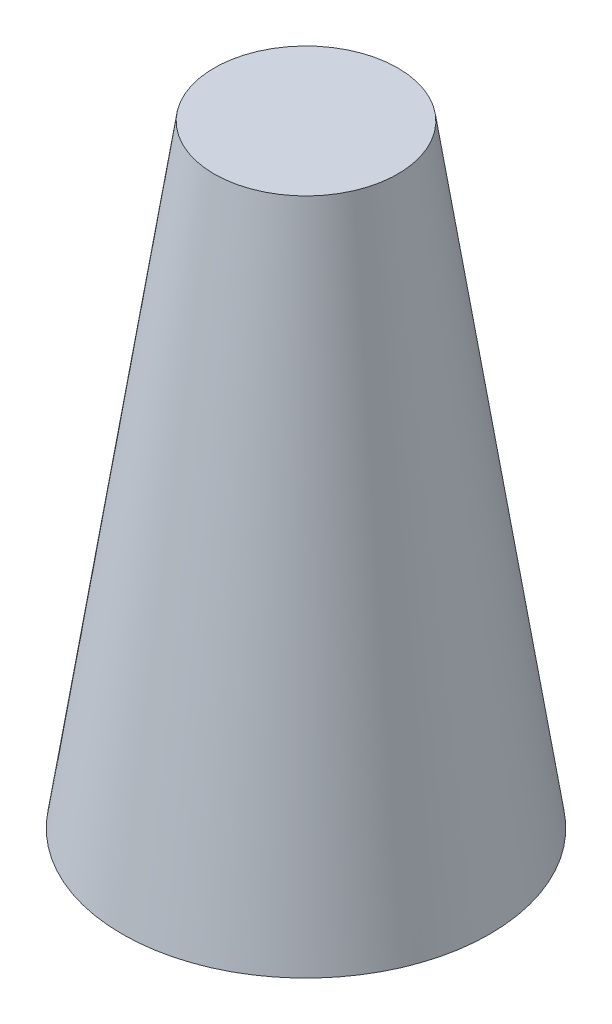
ISO-10303-21;
HEADER;
FILE_DESCRIPTION(('STEP AP214'),'2;1');
FILE_NAME('part.step','',(''),(''),'','','');
FILE_SCHEMA(('AUTOMOTIVE_DESIGN { 1 0 10303 214 1 1 1 1 }'));
ENDSEC;
DATA;
#1=APPLICATION_CONTEXT('core data for automotive mechanical design processes');
#2=APPLICATION_PROTOCOL_DEFINITION('international standard','automotive_design',2000,#1);
#3=PRODUCT_CONTEXT('',#1,'mechanical');
#4=PRODUCT('Part','Part','',(#3));
#5=PRODUCT_RELATED_PRODUCT_CATEGORY('part','',(#4));
#6=PRODUCT_DEFINITION_FORMATION('','',#4);
#7=PRODUCT_DEFINITION_CONTEXT('part definition',#1,'design');
#8=PRODUCT_DEFINITION('design','',#6,#7);
#9=PRODUCT_DEFINITION_SHAPE('','',#8);
#10=(LENGTH_UNIT() NAMED_UNIT(*) SI_UNIT(.MILLI.,.METRE.));
#11=(NAMED_UNIT(*) PLANE_ANGLE_UNIT() SI_UNIT($,.RADIAN.));
#12=(NAMED_UNIT(*) SI_UNIT($,.STERADIAN.) SOLID_ANGLE_UNIT());
#13=UNCERTAINTY_MEASURE_WITH_UNIT(LENGTH_MEASURE(1.E-05),#10,'distance_accuracy_value','');
#14=(GEOMETRIC_REPRESENTATION_CONTEXT(3) GLOBAL_UNCERTAINTY_ASSIGNED_CONTEXT((#13)) GLOBAL_UNIT_ASSIGNED_CONTEXT((#10,
#11,#12)) REPRESENTATION_CONTEXT('',''));
#15=CARTESIAN_POINT('',(0.,0.,0.));
#16=DIRECTION('',(0.,0.,1.));
#17=DIRECTION('',(1.,0.,0.));
#18=AXIS2_PLACEMENT_3D('',#15,#16,#17);
#19=CARTESIAN_POINT('',(0.,200.,0.));
#20=DIRECTION('',(0.,-1.,0.));
#21=DIRECTION('',(0.,0.,-1.));
#22=AXIS2_PLACEMENT_3D('',#19,#20,#21);
#23=PLANE('',#22);
#24=CARTESIAN_POINT('',(0.,200.,0.));
#25=DIRECTION('',(0.,-1.,0.));
#26=DIRECTION('',(0.,0.,-1.));
#27=AXIS2_PLACEMENT_3D('',#24,#25,#26);
#28=CIRCLE('',#27,30.);
#29=CARTESIAN_POINT('',(0.,200.,-30.));
#30=VERTEX_POINT('',#29);
#31=EDGE_CURVE('E60',#30,#30,#28,.T.);
#32=ORIENTED_EDGE('',*,*,#31,.F.);
#33=EDGE_LOOP('',(#32));
#34=FACE_BOUND('',#33,.T.);
#35=ADVANCED_FACE('F37',(#34),#23,.F.);
#36=CARTESIAN_POINT('',(0.,195.,0.));
#37=DIRECTION('',(0.,1.,0.));
#38=DIRECTION('',(0.,0.,1.));
#39=AXIS2_PLACEMENT_3D('',#36,#37,#38);
#40=PLANE('',#39);
#41=CARTESIAN_POINT('',(0.,195.,0.));
#42=DIRECTION('',(0.,-1.,0.));
#43=DIRECTION('',(0.,0.,-1.));
#44=AXIS2_PLACEMENT_3D('',#41,#42,#43);
#45=CIRCLE('',#44,17.0821886878825);
#46=CARTESIAN_POINT('',(0.,195.,-17.0821886878825));
#47=VERTEX_POINT('',#46);
#48=EDGE_CURVE('E10',#47,#47,#45,.T.);
#49=ORIENTED_EDGE('',*,*,#48,.T.);
#50=EDGE_LOOP('',(#49));
#51=FACE_BOUND('',#50,.T.);
#52=ADVANCED_FACE('F68',(#51),#40,.F.);
#53=CARTESIAN_POINT('',(0.,185.,0.));
#54=DIRECTION('',(0.,-1.,0.));
#55=DIRECTION('',(0.,0.,-1.));
#56=AXIS2_PLACEMENT_3D('',#53,#54,#55);
#57=TOROIDAL_SURFACE('',#56,17.0821886878825,10.);
#58=ORIENTED_EDGE('',*,*,#48,.F.);
#59=EDGE_LOOP('',(#58));
#60=FACE_BOUND('',#59,.T.);
#61=CARTESIAN_POINT('',(0.,186.483404529302,0.));
#62=DIRECTION('',(0.,-1.,0.));
#63=DIRECTION('',(0.,0.,-1.));
#64=AXIS2_PLACEMENT_3D('',#61,#62,#63);
#65=CIRCLE('',#64,26.9715522165655);
#66=CARTESIAN_POINT('',(0.,186.483404529302,-26.9715522165655));
#67=VERTEX_POINT('',#66);
#68=EDGE_CURVE('E44',#67,#67,#65,.T.);
#69=ORIENTED_EDGE('',*,*,#68,.T.);
#70=EDGE_LOOP('',(#69));
#71=FACE_BOUND('',#70,.T.);
#72=ADVANCED_FACE('F72',(#60,#71),#57,.F.);
#73=CARTESIAN_POINT('',(0.,0.,0.));
#74=DIRECTION('',(0.,-1.,0.));
#75=DIRECTION('',(0.,0.,-1.));
#76=AXIS2_PLACEMENT_3D('',#73,#74,#75);
#77=CONICAL_SURFACE('',#76,54.9440628959608,0.148889947609497);
#78=ORIENTED_EDGE('',*,*,#68,.F.);
#79=EDGE_LOOP('',(#78));
#80=FACE_BOUND('',#79,.T.);
#81=CARTESIAN_POINT('',(0.,0.,0.));
#82=DIRECTION('',(0.,-1.,0.));
#83=DIRECTION('',(0.,0.,-1.));
#84=AXIS2_PLACEMENT_3D('',#81,#82,#83);
#85=CIRCLE('',#84,54.9440628959608);
#86=CARTESIAN_POINT('',(0.,0.,-54.9440628959608));
#87=VERTEX_POINT('',#86);
#88=EDGE_CURVE('E49',#87,#87,#85,.T.);
#89=ORIENTED_EDGE('',*,*,#88,.T.);
#90=EDGE_LOOP('',(#89));
#91=FACE_BOUND('',#90,.T.);
#92=ADVANCED_FACE('F76',(#80,#91),#77,.F.);
#93=CARTESIAN_POINT('',(-60.,0.,0.));
#94=DIRECTION('',(0.,1.,0.));
#95=DIRECTION('',(0.,0.,1.));
#96=AXIS2_PLACEMENT_3D('',#93,#94,#95);
#97=PLANE('',#96);
#98=ORIENTED_EDGE('',*,*,#88,.F.);
#99=EDGE_LOOP('',(#98));
#100=FACE_BOUND('',#99,.T.);
#101=CARTESIAN_POINT('',(0.,0.,0.));
#102=DIRECTION('',(0.,-1.,0.));
#103=DIRECTION('',(0.,0.,-1.));
#104=AXIS2_PLACEMENT_3D('',#101,#102,#103);
#105=CIRCLE('',#104,60.);
#106=CARTESIAN_POINT('',(0.,0.,-60.));
#107=VERTEX_POINT('',#106);
#108=EDGE_CURVE('E54',#107,#107,#105,.T.);
#109=ORIENTED_EDGE('',*,*,#108,.T.);
#110=EDGE_LOOP('',(#109));
#111=FACE_BOUND('',#110,.T.);
#112=ADVANCED_FACE('F82',(#100,#111),#97,.F.);
#113=CARTESIAN_POINT('',(0.,200.,0.));
#114=DIRECTION('',(0.,-1.,0.));
#115=DIRECTION('',(0.,0.,-1.));
#116=AXIS2_PLACEMENT_3D('',#113,#114,#115);
#117=CONICAL_SURFACE('',#116,30.,0.148889947609497);
#118=ORIENTED_EDGE('',*,*,#108,.F.);
#119=EDGE_LOOP('',(#118));
#120=FACE_BOUND('',#119,.T.);
#121=ORIENTED_EDGE('',*,*,#31,.T.);
#122=EDGE_LOOP('',(#121));
#123=FACE_BOUND('',#122,.T.);
#124=ADVANCED_FACE('F65',(#120,#123),#117,.T.);
#125=CLOSED_SHELL('',(#35,#52,#72,#92,#112,#124));
#126=MANIFOLD_SOLID_BREP('B2',#125);
#127=ADVANCED_BREP_SHAPE_REPRESENTATION('',(#18,#126),#14);
#128=SHAPE_DEFINITION_REPRESENTATION(#9,#127);
ENDSEC;
END-ISO-10303-21;
